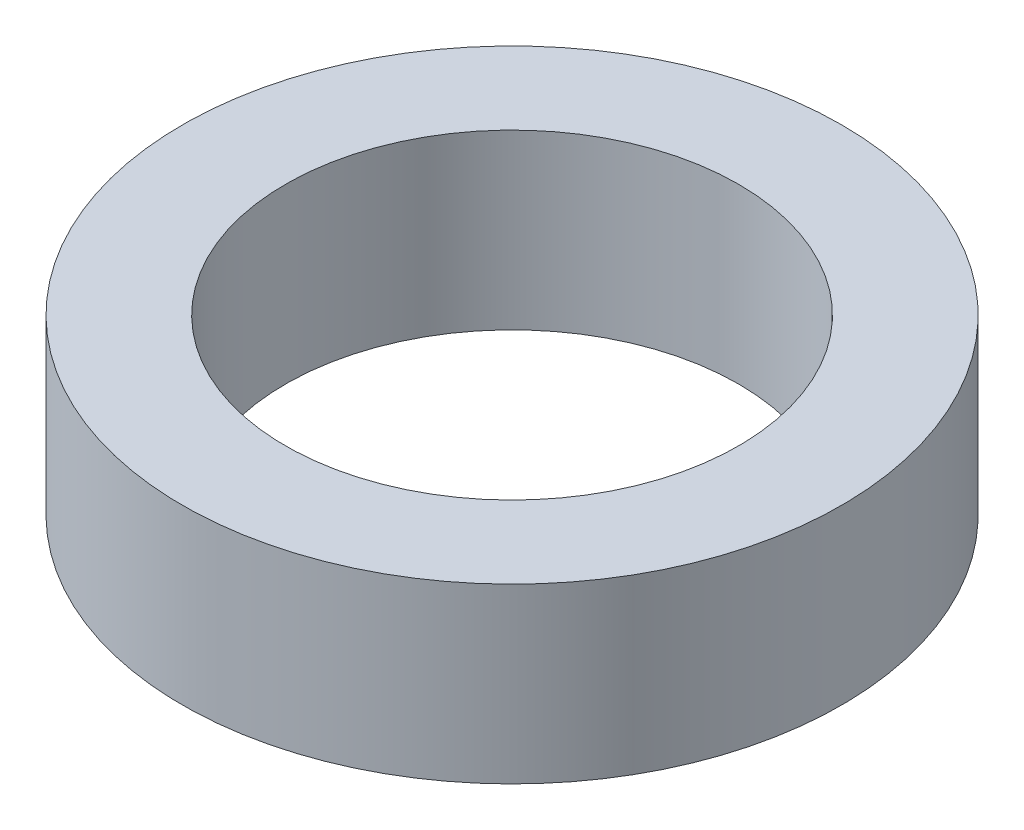
ISO-10303-21;
HEADER;
FILE_DESCRIPTION(('STEP AP214'),'2;1');
FILE_NAME('part.step','',(''),(''),'','','');
FILE_SCHEMA(('AUTOMOTIVE_DESIGN { 1 0 10303 214 1 1 1 1 }'));
ENDSEC;
DATA;
#1=APPLICATION_CONTEXT('core data for automotive mechanical design processes');
#2=APPLICATION_PROTOCOL_DEFINITION('international standard','automotive_design',2000,#1);
#3=PRODUCT_CONTEXT('',#1,'mechanical');
#4=PRODUCT('Part','Part','',(#3));
#5=PRODUCT_RELATED_PRODUCT_CATEGORY('part','',(#4));
#6=PRODUCT_DEFINITION_FORMATION('','',#4);
#7=PRODUCT_DEFINITION_CONTEXT('part definition',#1,'design');
#8=PRODUCT_DEFINITION('design','',#6,#7);
#9=PRODUCT_DEFINITION_SHAPE('','',#8);
#10=(LENGTH_UNIT() NAMED_UNIT(*) SI_UNIT(.MILLI.,.METRE.));
#11=(NAMED_UNIT(*) PLANE_ANGLE_UNIT() SI_UNIT($,.RADIAN.));
#12=(NAMED_UNIT(*) SI_UNIT($,.STERADIAN.) SOLID_ANGLE_UNIT());
#13=UNCERTAINTY_MEASURE_WITH_UNIT(LENGTH_MEASURE(1.E-05),#10,'distance_accuracy_value','');
#14=(GEOMETRIC_REPRESENTATION_CONTEXT(3) GLOBAL_UNCERTAINTY_ASSIGNED_CONTEXT((#13)) GLOBAL_UNIT_ASSIGNED_CONTEXT((#10,
#11,#12)) REPRESENTATION_CONTEXT('',''));
#15=CARTESIAN_POINT('',(0.,0.,0.));
#16=DIRECTION('',(0.,0.,1.));
#17=DIRECTION('',(1.,0.,0.));
#18=AXIS2_PLACEMENT_3D('',#15,#16,#17);
#19=CARTESIAN_POINT('',(0.,21.,0.));
#20=DIRECTION('',(0.,-1.,0.));
#21=DIRECTION('',(0.,0.,-1.));
#22=AXIS2_PLACEMENT_3D('',#19,#20,#21);
#23=CYLINDRICAL_SURFACE('',#22,40.);
#24=CARTESIAN_POINT('',(0.,21.,0.));
#25=DIRECTION('',(0.,1.,0.));
#26=DIRECTION('',(0.,0.,1.));
#27=AXIS2_PLACEMENT_3D('',#24,#25,#26);
#28=CIRCLE('',#27,40.);
#29=CARTESIAN_POINT('',(0.,21.,-40.));
#30=VERTEX_POINT('',#29);
#31=EDGE_CURVE('E10',#30,#30,#28,.T.);
#32=CARTESIAN_POINT('',(0.,0.,0.));
#33=DIRECTION('',(0.,1.,0.));
#34=DIRECTION('',(0.,0.,1.));
#35=AXIS2_PLACEMENT_3D('',#32,#33,#34);
#36=CIRCLE('',#35,40.);
#37=CARTESIAN_POINT('',(0.,0.,-40.));
#38=VERTEX_POINT('',#37);
#39=EDGE_CURVE('E37',#38,#38,#36,.T.);
#40=CARTESIAN_POINT('',(0.,21.,-40.));
#41=CARTESIAN_POINT('',(0.,20.78125,-40.));
#42=CARTESIAN_POINT('',(0.,20.5625,-40.));
#43=CARTESIAN_POINT('',(0.,20.125,-40.));
#44=CARTESIAN_POINT('',(0.,19.90625,-40.));
#45=CARTESIAN_POINT('',(0.,19.46875,-40.));
#46=CARTESIAN_POINT('',(0.,19.25,-40.));
#47=CARTESIAN_POINT('',(0.,18.8125,-40.));
#48=CARTESIAN_POINT('',(0.,18.59375,-40.));
#49=CARTESIAN_POINT('',(0.,18.15625,-40.));
#50=CARTESIAN_POINT('',(0.,17.9375,-40.));
#51=CARTESIAN_POINT('',(0.,17.5,-40.));
#52=CARTESIAN_POINT('',(0.,17.28125,-40.));
#53=CARTESIAN_POINT('',(0.,16.84375,-40.));
#54=CARTESIAN_POINT('',(0.,16.625,-40.));
#55=CARTESIAN_POINT('',(0.,16.1875,-40.));
#56=CARTESIAN_POINT('',(0.,15.96875,-40.));
#57=CARTESIAN_POINT('',(0.,15.53125,-40.));
#58=CARTESIAN_POINT('',(0.,15.3125,-40.));
#59=CARTESIAN_POINT('',(0.,14.875,-40.));
#60=CARTESIAN_POINT('',(0.,14.65625,-40.));
#61=CARTESIAN_POINT('',(0.,14.21875,-40.));
#62=CARTESIAN_POINT('',(0.,14.,-40.));
#63=CARTESIAN_POINT('',(0.,13.5625,-40.));
#64=CARTESIAN_POINT('',(0.,13.34375,-40.));
#65=CARTESIAN_POINT('',(0.,12.90625,-40.));
#66=CARTESIAN_POINT('',(0.,12.6875,-40.));
#67=CARTESIAN_POINT('',(0.,12.25,-40.));
#68=CARTESIAN_POINT('',(0.,12.03125,-40.));
#69=CARTESIAN_POINT('',(0.,11.59375,-40.));
#70=CARTESIAN_POINT('',(0.,11.375,-40.));
#71=CARTESIAN_POINT('',(0.,10.9375,-40.));
#72=CARTESIAN_POINT('',(0.,10.71875,-40.));
#73=CARTESIAN_POINT('',(0.,10.28125,-40.));
#74=CARTESIAN_POINT('',(0.,10.0625,-40.));
#75=CARTESIAN_POINT('',(0.,9.625,-40.));
#76=CARTESIAN_POINT('',(0.,9.40625,-40.));
#77=CARTESIAN_POINT('',(0.,8.96875,-40.));
#78=CARTESIAN_POINT('',(0.,8.75,-40.));
#79=CARTESIAN_POINT('',(0.,8.3125,-40.));
#80=CARTESIAN_POINT('',(0.,8.09375,-40.));
#81=CARTESIAN_POINT('',(0.,7.65625,-40.));
#82=CARTESIAN_POINT('',(0.,7.4375,-40.));
#83=CARTESIAN_POINT('',(0.,7.,-40.));
#84=CARTESIAN_POINT('',(0.,6.78125,-40.));
#85=CARTESIAN_POINT('',(0.,6.34375,-40.));
#86=CARTESIAN_POINT('',(0.,6.125,-40.));
#87=CARTESIAN_POINT('',(0.,5.6875,-40.));
#88=CARTESIAN_POINT('',(0.,5.46875,-40.));
#89=CARTESIAN_POINT('',(0.,5.03125,-40.));
#90=CARTESIAN_POINT('',(0.,4.8125,-40.));
#91=CARTESIAN_POINT('',(0.,4.375,-40.));
#92=CARTESIAN_POINT('',(0.,4.15625,-40.));
#93=CARTESIAN_POINT('',(0.,3.71875,-40.));
#94=CARTESIAN_POINT('',(0.,3.5,-40.));
#95=CARTESIAN_POINT('',(0.,3.0625,-40.));
#96=CARTESIAN_POINT('',(0.,2.84375,-40.));
#97=CARTESIAN_POINT('',(0.,2.40625,-40.));
#98=CARTESIAN_POINT('',(0.,2.1875,-40.));
#99=CARTESIAN_POINT('',(0.,1.75,-40.));
#100=CARTESIAN_POINT('',(0.,1.53125,-40.));
#101=CARTESIAN_POINT('',(0.,1.09375,-40.));
#102=CARTESIAN_POINT('',(0.,0.875000000000001,-40.));
#103=CARTESIAN_POINT('',(0.,0.4375,-40.));
#104=CARTESIAN_POINT('',(0.,0.21875,-40.));
#105=CARTESIAN_POINT('',(0.,0.,-40.));
#106=B_SPLINE_CURVE_WITH_KNOTS('',3,(#40,#41,#42,#43,#44,#45,#46,#47,#48,#49,#50,#51,#52,#53,
#54,#55,#56,#57,#58,#59,#60,#61,#62,#63,#64,#65,#66,#67,#68,#69,#70,#71,#72,#73,#74,#75,#76,#77,
#78,#79,#80,#81,#82,#83,#84,#85,#86,#87,#88,#89,#90,#91,#92,#93,#94,#95,#96,#97,#98,#99,#100,
#101,#102,#103,#104,#105),.UNSPECIFIED.,.F.,.F.,(4,2,2,2,2,2,2,2,2,2,2,2,2,2,2,2,2,2,2,2,2,2,2,
2,2,2,2,2,2,2,2,2,4),(0.,0.656249999999997,1.3125,1.96875,2.625,3.28125,3.9375,4.59375,5.25,
5.90625,6.5625,7.21875,7.875,8.53125,9.1875,9.84375,10.5,11.15625,11.8125,12.46875,13.125,
13.78125,14.4375,15.09375,15.75,16.40625,17.0625,17.71875,18.375,19.03125,19.6875,20.34375,21.),.UNSPECIFIED.);
#107=EDGE_CURVE('BSEAM40',#30,#38,#106,.T.);
#108=ORIENTED_EDGE('',*,*,#31,.F.);
#109=ORIENTED_EDGE('',*,*,#39,.T.);
#110=ORIENTED_EDGE('',*,*,#107,.T.);
#111=ORIENTED_EDGE('',*,*,#107,.F.);
#112=EDGE_LOOP('',(#108,#110,#109,#111));
#113=FACE_BOUND('',#112,.T.);
#114=ADVANCED_FACE('F40',(#113),#23,.T.);
#115=CARTESIAN_POINT('',(0.,21.,0.));
#116=DIRECTION('',(0.,1.,0.));
#117=DIRECTION('',(0.,0.,1.));
#118=AXIS2_PLACEMENT_3D('',#115,#116,#117);
#119=PLANE('',#118);
#120=CARTESIAN_POINT('',(0.,21.,0.));
#121=DIRECTION('',(0.,1.,0.));
#122=DIRECTION('',(0.,0.,1.));
#123=AXIS2_PLACEMENT_3D('',#120,#121,#122);
#124=CIRCLE('',#123,27.5);
#125=CARTESIAN_POINT('',(0.,21.,-27.5));
#126=VERTEX_POINT('',#125);
#127=EDGE_CURVE('E50',#126,#126,#124,.T.);
#128=ORIENTED_EDGE('',*,*,#127,.F.);
#129=EDGE_LOOP('',(#128));
#130=FACE_BOUND('',#129,.T.);
#131=ORIENTED_EDGE('',*,*,#31,.T.);
#132=EDGE_LOOP('',(#131));
#133=FACE_BOUND('',#132,.T.);
#134=ADVANCED_FACE('F59',(#130,#133),#119,.T.);
#135=CARTESIAN_POINT('',(0.,0.,0.));
#136=DIRECTION('',(0.,1.,0.));
#137=DIRECTION('',(0.,0.,1.));
#138=AXIS2_PLACEMENT_3D('',#135,#136,#137);
#139=PLANE('',#138);
#140=CARTESIAN_POINT('',(0.,0.,0.));
#141=DIRECTION('',(0.,1.,0.));
#142=DIRECTION('',(0.,0.,1.));
#143=AXIS2_PLACEMENT_3D('',#140,#141,#142);
#144=CIRCLE('',#143,27.5);
#145=CARTESIAN_POINT('',(0.,0.,-27.5));
#146=VERTEX_POINT('',#145);
#147=EDGE_CURVE('E47',#146,#146,#144,.T.);
#148=ORIENTED_EDGE('',*,*,#147,.T.);
#149=EDGE_LOOP('',(#148));
#150=FACE_BOUND('',#149,.T.);
#151=ORIENTED_EDGE('',*,*,#39,.F.);
#152=EDGE_LOOP('',(#151));
#153=FACE_BOUND('',#152,.T.);
#154=ADVANCED_FACE('F58',(#150,#153),#139,.F.);
#155=CARTESIAN_POINT('',(0.,21.,0.));
#156=DIRECTION('',(0.,-1.,0.));
#157=DIRECTION('',(0.,0.,-1.));
#158=AXIS2_PLACEMENT_3D('',#155,#156,#157);
#159=CYLINDRICAL_SURFACE('',#158,27.5);
#160=CARTESIAN_POINT('',(0.,21.,-27.5));
#161=CARTESIAN_POINT('',(0.,20.78125,-27.5));
#162=CARTESIAN_POINT('',(0.,20.5625,-27.5));
#163=CARTESIAN_POINT('',(0.,20.125,-27.5));
#164=CARTESIAN_POINT('',(0.,19.90625,-27.5));
#165=CARTESIAN_POINT('',(0.,19.46875,-27.5));
#166=CARTESIAN_POINT('',(0.,19.25,-27.5));
#167=CARTESIAN_POINT('',(0.,18.8125,-27.5));
#168=CARTESIAN_POINT('',(0.,18.59375,-27.5));
#169=CARTESIAN_POINT('',(0.,18.15625,-27.5));
#170=CARTESIAN_POINT('',(0.,17.9375,-27.5));
#171=CARTESIAN_POINT('',(0.,17.5,-27.5));
#172=CARTESIAN_POINT('',(0.,17.28125,-27.5));
#173=CARTESIAN_POINT('',(0.,16.84375,-27.5));
#174=CARTESIAN_POINT('',(0.,16.625,-27.5));
#175=CARTESIAN_POINT('',(0.,16.1875,-27.5));
#176=CARTESIAN_POINT('',(0.,15.96875,-27.5));
#177=CARTESIAN_POINT('',(0.,15.53125,-27.5));
#178=CARTESIAN_POINT('',(0.,15.3125,-27.5));
#179=CARTESIAN_POINT('',(0.,14.875,-27.5));
#180=CARTESIAN_POINT('',(0.,14.65625,-27.5));
#181=CARTESIAN_POINT('',(0.,14.21875,-27.5));
#182=CARTESIAN_POINT('',(0.,14.,-27.5));
#183=CARTESIAN_POINT('',(0.,13.5625,-27.5));
#184=CARTESIAN_POINT('',(0.,13.34375,-27.5));
#185=CARTESIAN_POINT('',(0.,12.90625,-27.5));
#186=CARTESIAN_POINT('',(0.,12.6875,-27.5));
#187=CARTESIAN_POINT('',(0.,12.25,-27.5));
#188=CARTESIAN_POINT('',(0.,12.03125,-27.5));
#189=CARTESIAN_POINT('',(0.,11.59375,-27.5));
#190=CARTESIAN_POINT('',(0.,11.375,-27.5));
#191=CARTESIAN_POINT('',(0.,10.9375,-27.5));
#192=CARTESIAN_POINT('',(0.,10.71875,-27.5));
#193=CARTESIAN_POINT('',(0.,10.28125,-27.5));
#194=CARTESIAN_POINT('',(0.,10.0625,-27.5));
#195=CARTESIAN_POINT('',(0.,9.625,-27.5));
#196=CARTESIAN_POINT('',(0.,9.40625,-27.5));
#197=CARTESIAN_POINT('',(0.,8.96875,-27.5));
#198=CARTESIAN_POINT('',(0.,8.75,-27.5));
#199=CARTESIAN_POINT('',(0.,8.3125,-27.5));
#200=CARTESIAN_POINT('',(0.,8.09375,-27.5));
#201=CARTESIAN_POINT('',(0.,7.65625,-27.5));
#202=CARTESIAN_POINT('',(0.,7.4375,-27.5));
#203=CARTESIAN_POINT('',(0.,7.,-27.5));
#204=CARTESIAN_POINT('',(0.,6.78125,-27.5));
#205=CARTESIAN_POINT('',(0.,6.34375,-27.5));
#206=CARTESIAN_POINT('',(0.,6.125,-27.5));
#207=CARTESIAN_POINT('',(0.,5.6875,-27.5));
#208=CARTESIAN_POINT('',(0.,5.46875,-27.5));
#209=CARTESIAN_POINT('',(0.,5.03125,-27.5));
#210=CARTESIAN_POINT('',(0.,4.8125,-27.5));
#211=CARTESIAN_POINT('',(0.,4.375,-27.5));
#212=CARTESIAN_POINT('',(0.,4.15625,-27.5));
#213=CARTESIAN_POINT('',(0.,3.71875,-27.5));
#214=CARTESIAN_POINT('',(0.,3.5,-27.5));
#215=CARTESIAN_POINT('',(0.,3.0625,-27.5));
#216=CARTESIAN_POINT('',(0.,2.84375,-27.5));
#217=CARTESIAN_POINT('',(0.,2.40625,-27.5));
#218=CARTESIAN_POINT('',(0.,2.1875,-27.5));
#219=CARTESIAN_POINT('',(0.,1.75,-27.5));
#220=CARTESIAN_POINT('',(0.,1.53125,-27.5));
#221=CARTESIAN_POINT('',(0.,1.09375,-27.5));
#222=CARTESIAN_POINT('',(0.,0.875000000000001,-27.5));
#223=CARTESIAN_POINT('',(0.,0.4375,-27.5));
#224=CARTESIAN_POINT('',(0.,0.21875,-27.5));
#225=CARTESIAN_POINT('',(0.,0.,-27.5));
#226=B_SPLINE_CURVE_WITH_KNOTS('',3,(#160,#161,#162,#163,#164,#165,#166,#167,#168,#169,#170,
#171,#172,#173,#174,#175,#176,#177,#178,#179,#180,#181,#182,#183,#184,#185,#186,#187,#188,#189,
#190,#191,#192,#193,#194,#195,#196,#197,#198,#199,#200,#201,#202,#203,#204,#205,#206,#207,#208,
#209,#210,#211,#212,#213,#214,#215,#216,#217,#218,#219,#220,#221,#222,#223,#224,#225),
.UNSPECIFIED.,.F.,.F.,(4,2,2,2,2,2,2,2,2,2,2,2,2,2,2,2,2,2,2,2,2,2,2,2,2,2,2,2,2,2,2,2,4),(0.,
0.656250000000001,1.3125,1.96875,2.625,3.28125,3.9375,4.59375,5.25,5.90625,6.5625,7.21875,7.875,
8.53125,9.1875,9.84375,10.5,11.15625,11.8125,12.46875,13.125,13.78125,14.4375,15.09375,15.75,
16.40625,17.0625,17.71875,18.375,19.03125,19.6875,20.34375,21.),.UNSPECIFIED.);
#227=EDGE_CURVE('BSEAM54',#126,#146,#226,.T.);
#228=ORIENTED_EDGE('',*,*,#127,.T.);
#229=ORIENTED_EDGE('',*,*,#147,.F.);
#230=ORIENTED_EDGE('',*,*,#227,.T.);
#231=ORIENTED_EDGE('',*,*,#227,.F.);
#232=EDGE_LOOP('',(#228,#230,#229,#231));
#233=FACE_BOUND('',#232,.T.);
#234=ADVANCED_FACE('F54',(#233),#159,.F.);
#235=CLOSED_SHELL('',(#114,#134,#154,#234));
#236=MANIFOLD_SOLID_BREP('B2',#235);
#237=ADVANCED_BREP_SHAPE_REPRESENTATION('',(#18,#236),#14);
#238=SHAPE_DEFINITION_REPRESENTATION(#9,#237);
ENDSEC;
END-ISO-10303-21;
